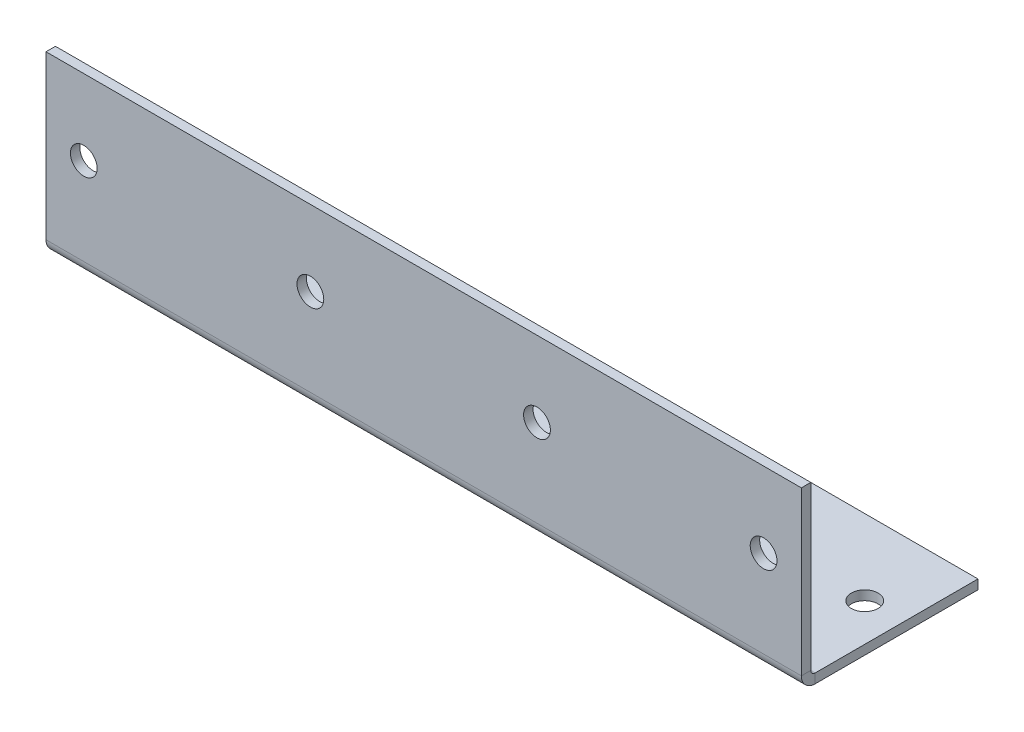
ISO-10303-21;
HEADER;
FILE_DESCRIPTION(('STEP AP214'),'2;1');
FILE_NAME('part.step','',(''),(''),'','','');
FILE_SCHEMA(('AUTOMOTIVE_DESIGN { 1 0 10303 214 1 1 1 1 }'));
ENDSEC;
DATA;
#1=APPLICATION_CONTEXT('core data for automotive mechanical design processes');
#2=APPLICATION_PROTOCOL_DEFINITION('international standard','automotive_design',2000,#1);
#3=PRODUCT_CONTEXT('',#1,'mechanical');
#4=PRODUCT('Part','Part','',(#3));
#5=PRODUCT_RELATED_PRODUCT_CATEGORY('part','',(#4));
#6=PRODUCT_DEFINITION_FORMATION('','',#4);
#7=PRODUCT_DEFINITION_CONTEXT('part definition',#1,'design');
#8=PRODUCT_DEFINITION('design','',#6,#7);
#9=PRODUCT_DEFINITION_SHAPE('','',#8);
#10=(LENGTH_UNIT() NAMED_UNIT(*) SI_UNIT(.MILLI.,.METRE.));
#11=(NAMED_UNIT(*) PLANE_ANGLE_UNIT() SI_UNIT($,.RADIAN.));
#12=(NAMED_UNIT(*) SI_UNIT($,.STERADIAN.) SOLID_ANGLE_UNIT());
#13=UNCERTAINTY_MEASURE_WITH_UNIT(LENGTH_MEASURE(1.E-05),#10,'distance_accuracy_value','');
#14=(GEOMETRIC_REPRESENTATION_CONTEXT(3) GLOBAL_UNCERTAINTY_ASSIGNED_CONTEXT((#13)) GLOBAL_UNIT_ASSIGNED_CONTEXT((#10,
#11,#12)) REPRESENTATION_CONTEXT('',''));
#15=CARTESIAN_POINT('',(0.,0.,0.));
#16=DIRECTION('',(0.,0.,1.));
#17=DIRECTION('',(1.,0.,0.));
#18=AXIS2_PLACEMENT_3D('',#15,#16,#17);
#19=CARTESIAN_POINT('',(63.5,-15.4096659206447,2.05283407935528));
#20=DIRECTION('',(1.,0.,0.));
#21=DIRECTION('',(0.,1.,0.));
#22=AXIS2_PLACEMENT_3D('',#19,#20,#21);
#23=PLANE('',#22);
#24=DIRECTION('',(0.,0.,1.));
#25=VECTOR('',#24,1.);
#26=CARTESIAN_POINT('',(63.5,-15.4096659206447,-4.29716592064472));
#27=LINE('',#26,#25);
#28=CARTESIAN_POINT('',(63.5,-15.4096659206446,-29.6971659206447));
#29=VERTEX_POINT('',#28);
#30=CARTESIAN_POINT('',(63.5,-15.4096659206447,-2.3241));
#31=VERTEX_POINT('',#30);
#32=EDGE_CURVE('E230',#29,#31,#27,.T.);
#33=ORIENTED_EDGE('',*,*,#32,.T.);
#34=DIRECTION('',(0.,-1.,0.));
#35=VECTOR('',#34,1.);
#36=CARTESIAN_POINT('',(63.5,-15.4096659206447,-2.3241));
#37=LINE('',#36,#35);
#38=CARTESIAN_POINT('',(63.5,-16.9971659206447,-2.32410000000001));
#39=VERTEX_POINT('',#38);
#40=EDGE_CURVE('E12',#31,#39,#37,.T.);
#41=ORIENTED_EDGE('',*,*,#40,.T.);
#42=DIRECTION('',(0.,0.,1.));
#43=VECTOR('',#42,1.);
#44=CARTESIAN_POINT('',(63.5,-16.9971659206447,2.05283407935528));
#45=LINE('',#44,#43);
#46=CARTESIAN_POINT('',(63.5,-16.9971659206446,-29.6971659206447));
#47=VERTEX_POINT('',#46);
#48=EDGE_CURVE('E63',#47,#39,#45,.T.);
#49=ORIENTED_EDGE('',*,*,#48,.F.);
#50=DIRECTION('',(0.,-1.,0.));
#51=VECTOR('',#50,1.);
#52=CARTESIAN_POINT('',(63.5,-15.4096659206446,-29.6971659206447));
#53=LINE('',#52,#51);
#54=EDGE_CURVE('E137',#29,#47,#53,.T.);
#55=ORIENTED_EDGE('',*,*,#54,.F.);
#56=EDGE_LOOP('',(#33,#41,#49,#55));
#57=FACE_BOUND('',#56,.T.);
#58=ADVANCED_FACE('F47',(#57),#23,.T.);
#59=CARTESIAN_POINT('',(-63.5,-15.4096659206447,-4.29716592064473));
#60=DIRECTION('',(-1.,0.,0.));
#61=DIRECTION('',(0.,-1.,0.));
#62=AXIS2_PLACEMENT_3D('',#59,#60,#61);
#63=PLANE('',#62);
#64=DIRECTION('',(0.,0.,-1.));
#65=VECTOR('',#64,1.);
#66=CARTESIAN_POINT('',(-63.5,-16.9971659206447,-4.29716592064473));
#67=LINE('',#66,#65);
#68=CARTESIAN_POINT('',(-63.5,-16.9971659206447,-2.32410000000001));
#69=VERTEX_POINT('',#68);
#70=CARTESIAN_POINT('',(-63.5,-16.9971659206446,-29.6971659206447));
#71=VERTEX_POINT('',#70);
#72=EDGE_CURVE('E70',#69,#71,#67,.T.);
#73=ORIENTED_EDGE('',*,*,#72,.F.);
#74=DIRECTION('',(0.,1.,0.));
#75=VECTOR('',#74,1.);
#76=CARTESIAN_POINT('',(-63.5,-15.4096659206447,-2.3241));
#77=LINE('',#76,#75);
#78=CARTESIAN_POINT('',(-63.4999999999999,-15.4096659206447,-2.3241));
#79=VERTEX_POINT('',#78);
#80=EDGE_CURVE('E110',#69,#79,#77,.T.);
#81=ORIENTED_EDGE('',*,*,#80,.T.);
#82=DIRECTION('',(0.,0.,-1.));
#83=VECTOR('',#82,1.);
#84=CARTESIAN_POINT('',(-63.5,-15.4096659206447,2.05283407935527));
#85=LINE('',#84,#83);
#86=CARTESIAN_POINT('',(-63.5,-15.4096659206446,-29.6971659206447));
#87=VERTEX_POINT('',#86);
#88=EDGE_CURVE('E50',#79,#87,#85,.T.);
#89=ORIENTED_EDGE('',*,*,#88,.T.);
#90=DIRECTION('',(0.,-1.,0.));
#91=VECTOR('',#90,1.);
#92=CARTESIAN_POINT('',(-63.5,-15.4096659206446,-29.6971659206447));
#93=LINE('',#92,#91);
#94=EDGE_CURVE('E235',#87,#71,#93,.T.);
#95=ORIENTED_EDGE('',*,*,#94,.T.);
#96=EDGE_LOOP('',(#73,#81,#89,#95));
#97=FACE_BOUND('',#96,.T.);
#98=ADVANCED_FACE('F112',(#97),#63,.T.);
#99=CARTESIAN_POINT('',(0.,-16.9971659206448,14.7528340793553));
#100=DIRECTION('',(0.,-1.,0.));
#101=DIRECTION('',(1.,0.,0.));
#102=AXIS2_PLACEMENT_3D('',#99,#100,#101);
#103=PLANE('',#102);
#104=CARTESIAN_POINT('',(57.15,-16.9971659206447,-16.9971659206447));
#105=DIRECTION('',(0.,-1.,0.));
#106=DIRECTION('',(-1.,0.,0.));
#107=AXIS2_PLACEMENT_3D('',#104,#105,#106);
#108=CIRCLE('',#107,2.25);
#109=CARTESIAN_POINT('',(54.9,-16.9971659206447,-16.9971659206447));
#110=VERTEX_POINT('',#109);
#111=EDGE_CURVE('E221',#110,#110,#108,.T.);
#112=ORIENTED_EDGE('',*,*,#111,.F.);
#113=EDGE_LOOP('',(#112));
#114=FACE_BOUND('',#113,.T.);
#115=CARTESIAN_POINT('',(19.05,-16.9971659206447,-16.9971659206447));
#116=DIRECTION('',(0.,-1.,0.));
#117=DIRECTION('',(-1.,0.,0.));
#118=AXIS2_PLACEMENT_3D('',#115,#116,#117);
#119=CIRCLE('',#118,2.25);
#120=CARTESIAN_POINT('',(16.8,-16.9971659206447,-16.9971659206447));
#121=VERTEX_POINT('',#120);
#122=EDGE_CURVE('E215',#121,#121,#119,.T.);
#123=ORIENTED_EDGE('',*,*,#122,.F.);
#124=EDGE_LOOP('',(#123));
#125=FACE_BOUND('',#124,.T.);
#126=CARTESIAN_POINT('',(-19.05,-16.9971659206447,-16.9971659206447));
#127=DIRECTION('',(0.,-1.,0.));
#128=DIRECTION('',(-1.,0.,0.));
#129=AXIS2_PLACEMENT_3D('',#126,#127,#128);
#130=CIRCLE('',#129,2.25);
#131=CARTESIAN_POINT('',(-21.3,-16.9971659206447,-16.9971659206447));
#132=VERTEX_POINT('',#131);
#133=EDGE_CURVE('E209',#132,#132,#130,.T.);
#134=ORIENTED_EDGE('',*,*,#133,.F.);
#135=EDGE_LOOP('',(#134));
#136=FACE_BOUND('',#135,.T.);
#137=CARTESIAN_POINT('',(-57.15,-16.9971659206447,-16.9971659206447));
#138=DIRECTION('',(0.,-1.,0.));
#139=DIRECTION('',(-1.,0.,0.));
#140=AXIS2_PLACEMENT_3D('',#137,#138,#139);
#141=CIRCLE('',#140,2.25);
#142=CARTESIAN_POINT('',(-59.4,-16.9971659206447,-16.9971659206447));
#143=VERTEX_POINT('',#142);
#144=EDGE_CURVE('E158',#143,#143,#141,.T.);
#145=ORIENTED_EDGE('',*,*,#144,.F.);
#146=EDGE_LOOP('',(#145));
#147=FACE_BOUND('',#146,.T.);
#148=ORIENTED_EDGE('',*,*,#48,.T.);
#149=DIRECTION('',(-1.,0.,0.));
#150=VECTOR('',#149,1.);
#151=CARTESIAN_POINT('',(0.,-16.9971659206447,-2.32410000000002));
#152=LINE('',#151,#150);
#153=EDGE_CURVE('E55',#39,#69,#152,.T.);
#154=ORIENTED_EDGE('',*,*,#153,.T.);
#155=ORIENTED_EDGE('',*,*,#72,.T.);
#156=DIRECTION('',(1.,0.,0.));
#157=VECTOR('',#156,1.);
#158=CARTESIAN_POINT('',(63.5,-16.9971659206446,-29.6971659206447));
#159=LINE('',#158,#157);
#160=EDGE_CURVE('E231',#71,#47,#159,.T.);
#161=ORIENTED_EDGE('',*,*,#160,.T.);
#162=EDGE_LOOP('',(#148,#154,#155,#161));
#163=FACE_BOUND('',#162,.T.);
#164=ADVANCED_FACE('F239',(#114,#125,#136,#147,#163),#103,.T.);
#165=CARTESIAN_POINT('',(63.5,-15.4096659206446,-29.6971659206447));
#166=DIRECTION('',(0.,0.,-1.));
#167=DIRECTION('',(1.,0.,0.));
#168=AXIS2_PLACEMENT_3D('',#165,#166,#167);
#169=PLANE('',#168);
#170=ORIENTED_EDGE('',*,*,#160,.F.);
#171=ORIENTED_EDGE('',*,*,#94,.F.);
#172=DIRECTION('',(1.,0.,0.));
#173=VECTOR('',#172,1.);
#174=CARTESIAN_POINT('',(63.5,-15.4096659206446,-29.6971659206447));
#175=LINE('',#174,#173);
#176=EDGE_CURVE('E128',#87,#29,#175,.T.);
#177=ORIENTED_EDGE('',*,*,#176,.T.);
#178=ORIENTED_EDGE('',*,*,#54,.T.);
#179=EDGE_LOOP('',(#170,#171,#177,#178));
#180=FACE_BOUND('',#179,.T.);
#181=ADVANCED_FACE('F243',(#180),#169,.T.);
#182=CARTESIAN_POINT('',(0.,-15.4096659206448,14.7528340793553));
#183=DIRECTION('',(0.,-1.,0.));
#184=DIRECTION('',(1.,0.,0.));
#185=AXIS2_PLACEMENT_3D('',#182,#183,#184);
#186=PLANE('',#185);
#187=DIRECTION('',(-1.,0.,0.));
#188=VECTOR('',#187,1.);
#189=CARTESIAN_POINT('',(0.,-15.4096659206447,-2.3241));
#190=LINE('',#189,#188);
#191=EDGE_CURVE('E118',#31,#79,#190,.T.);
#192=ORIENTED_EDGE('',*,*,#191,.F.);
#193=ORIENTED_EDGE('',*,*,#32,.F.);
#194=ORIENTED_EDGE('',*,*,#176,.F.);
#195=ORIENTED_EDGE('',*,*,#88,.F.);
#196=EDGE_LOOP('',(#192,#193,#194,#195));
#197=FACE_BOUND('',#196,.T.);
#198=CARTESIAN_POINT('',(-57.15,-15.4096659206447,-16.9971659206447));
#199=DIRECTION('',(0.,-1.,0.));
#200=DIRECTION('',(-1.,0.,0.));
#201=AXIS2_PLACEMENT_3D('',#198,#199,#200);
#202=CIRCLE('',#201,2.25);
#203=CARTESIAN_POINT('',(-59.4,-15.4096659206447,-16.9971659206447));
#204=VERTEX_POINT('',#203);
#205=EDGE_CURVE('E206',#204,#204,#202,.T.);
#206=ORIENTED_EDGE('',*,*,#205,.T.);
#207=EDGE_LOOP('',(#206));
#208=FACE_BOUND('',#207,.T.);
#209=CARTESIAN_POINT('',(-19.05,-15.4096659206447,-16.9971659206447));
#210=DIRECTION('',(0.,-1.,0.));
#211=DIRECTION('',(-1.,0.,0.));
#212=AXIS2_PLACEMENT_3D('',#209,#210,#211);
#213=CIRCLE('',#212,2.25);
#214=CARTESIAN_POINT('',(-21.3,-15.4096659206447,-16.9971659206447));
#215=VERTEX_POINT('',#214);
#216=EDGE_CURVE('E212',#215,#215,#213,.T.);
#217=ORIENTED_EDGE('',*,*,#216,.T.);
#218=EDGE_LOOP('',(#217));
#219=FACE_BOUND('',#218,.T.);
#220=CARTESIAN_POINT('',(19.05,-15.4096659206447,-16.9971659206447));
#221=DIRECTION('',(0.,-1.,0.));
#222=DIRECTION('',(-1.,0.,0.));
#223=AXIS2_PLACEMENT_3D('',#220,#221,#222);
#224=CIRCLE('',#223,2.25);
#225=CARTESIAN_POINT('',(16.8,-15.4096659206447,-16.9971659206447));
#226=VERTEX_POINT('',#225);
#227=EDGE_CURVE('E218',#226,#226,#224,.T.);
#228=ORIENTED_EDGE('',*,*,#227,.T.);
#229=EDGE_LOOP('',(#228));
#230=FACE_BOUND('',#229,.T.);
#231=CARTESIAN_POINT('',(57.15,-15.4096659206447,-16.9971659206447));
#232=DIRECTION('',(0.,-1.,0.));
#233=DIRECTION('',(-1.,0.,0.));
#234=AXIS2_PLACEMENT_3D('',#231,#232,#233);
#235=CIRCLE('',#234,2.25);
#236=CARTESIAN_POINT('',(54.9,-15.4096659206447,-16.9971659206447));
#237=VERTEX_POINT('',#236);
#238=EDGE_CURVE('E224',#237,#237,#235,.T.);
#239=ORIENTED_EDGE('',*,*,#238,.T.);
#240=EDGE_LOOP('',(#239));
#241=FACE_BOUND('',#240,.T.);
#242=ADVANCED_FACE('F123',(#197,#208,#219,#230,#241),#186,.F.);
#243=CARTESIAN_POINT('',(57.15,-15.4096659206447,-16.9971659206447));
#244=DIRECTION('',(0.,-1.,0.));
#245=DIRECTION('',(1.,0.,0.));
#246=AXIS2_PLACEMENT_3D('',#243,#244,#245);
#247=CYLINDRICAL_SURFACE('',#246,2.25);
#248=ORIENTED_EDGE('',*,*,#238,.F.);
#249=EDGE_LOOP('',(#248));
#250=FACE_BOUND('',#249,.T.);
#251=ORIENTED_EDGE('',*,*,#111,.T.);
#252=EDGE_LOOP('',(#251));
#253=FACE_BOUND('',#252,.T.);
#254=ADVANCED_FACE('F295',(#250,#253),#247,.F.);
#255=CARTESIAN_POINT('',(19.05,-15.4096659206447,-16.9971659206447));
#256=DIRECTION('',(0.,-1.,0.));
#257=DIRECTION('',(1.,0.,0.));
#258=AXIS2_PLACEMENT_3D('',#255,#256,#257);
#259=CYLINDRICAL_SURFACE('',#258,2.25);
#260=ORIENTED_EDGE('',*,*,#227,.F.);
#261=EDGE_LOOP('',(#260));
#262=FACE_BOUND('',#261,.T.);
#263=ORIENTED_EDGE('',*,*,#122,.T.);
#264=EDGE_LOOP('',(#263));
#265=FACE_BOUND('',#264,.T.);
#266=ADVANCED_FACE('F300',(#262,#265),#259,.F.);
#267=CARTESIAN_POINT('',(-19.05,-15.4096659206447,-16.9971659206447));
#268=DIRECTION('',(0.,-1.,0.));
#269=DIRECTION('',(1.,0.,0.));
#270=AXIS2_PLACEMENT_3D('',#267,#268,#269);
#271=CYLINDRICAL_SURFACE('',#270,2.25);
#272=ORIENTED_EDGE('',*,*,#216,.F.);
#273=EDGE_LOOP('',(#272));
#274=FACE_BOUND('',#273,.T.);
#275=ORIENTED_EDGE('',*,*,#133,.T.);
#276=EDGE_LOOP('',(#275));
#277=FACE_BOUND('',#276,.T.);
#278=ADVANCED_FACE('F279',(#274,#277),#271,.F.);
#279=CARTESIAN_POINT('',(-57.15,-15.4096659206447,-16.9971659206447));
#280=DIRECTION('',(0.,-1.,0.));
#281=DIRECTION('',(1.,0.,0.));
#282=AXIS2_PLACEMENT_3D('',#279,#280,#281);
#283=CYLINDRICAL_SURFACE('',#282,2.25);
#284=ORIENTED_EDGE('',*,*,#205,.F.);
#285=EDGE_LOOP('',(#284));
#286=FACE_BOUND('',#285,.T.);
#287=ORIENTED_EDGE('',*,*,#144,.T.);
#288=EDGE_LOOP('',(#287));
#289=FACE_BOUND('',#288,.T.);
#290=ADVANCED_FACE('F270',(#286,#289),#283,.F.);
#291=CARTESIAN_POINT('',(63.5,12.7,-1.5875));
#292=DIRECTION('',(0.,1.,0.));
#293=DIRECTION('',(-1.,0.,0.));
#294=AXIS2_PLACEMENT_3D('',#291,#292,#293);
#295=PLANE('',#294);
#296=DIRECTION('',(-1.,0.,0.));
#297=VECTOR('',#296,1.);
#298=CARTESIAN_POINT('',(63.5,12.7,0.));
#299=LINE('',#298,#297);
#300=CARTESIAN_POINT('',(63.5,12.7,0.));
#301=VERTEX_POINT('',#300);
#302=CARTESIAN_POINT('',(-63.5,12.7,0.));
#303=VERTEX_POINT('',#302);
#304=EDGE_CURVE('E163',#301,#303,#299,.T.);
#305=ORIENTED_EDGE('',*,*,#304,.F.);
#306=DIRECTION('',(0.,0.,1.));
#307=VECTOR('',#306,1.);
#308=CARTESIAN_POINT('',(63.5,12.7,-1.5875));
#309=LINE('',#308,#307);
#310=CARTESIAN_POINT('',(63.5,12.7,-1.5875));
#311=VERTEX_POINT('',#310);
#312=EDGE_CURVE('E155',#311,#301,#309,.T.);
#313=ORIENTED_EDGE('',*,*,#312,.F.);
#314=DIRECTION('',(-1.,0.,0.));
#315=VECTOR('',#314,1.);
#316=CARTESIAN_POINT('',(63.5,12.7,-1.5875));
#317=LINE('',#316,#315);
#318=CARTESIAN_POINT('',(-63.5,12.7,-1.5875));
#319=VERTEX_POINT('',#318);
#320=EDGE_CURVE('E200',#311,#319,#317,.T.);
#321=ORIENTED_EDGE('',*,*,#320,.T.);
#322=DIRECTION('',(0.,0.,1.));
#323=VECTOR('',#322,1.);
#324=CARTESIAN_POINT('',(-63.5,12.7,-1.5875));
#325=LINE('',#324,#323);
#326=EDGE_CURVE('E197',#319,#303,#325,.T.);
#327=ORIENTED_EDGE('',*,*,#326,.T.);
#328=EDGE_LOOP('',(#305,#313,#321,#327));
#329=FACE_BOUND('',#328,.T.);
#330=ADVANCED_FACE('F267',(#329),#295,.T.);
#331=CARTESIAN_POINT('',(57.15,0.,-1.5875));
#332=DIRECTION('',(0.,0.,1.));
#333=DIRECTION('',(1.,0.,0.));
#334=AXIS2_PLACEMENT_3D('',#331,#332,#333);
#335=CYLINDRICAL_SURFACE('',#334,2.25);
#336=CARTESIAN_POINT('',(57.15,0.,-1.5875));
#337=DIRECTION('',(0.,0.,1.));
#338=DIRECTION('',(1.,0.,0.));
#339=AXIS2_PLACEMENT_3D('',#336,#337,#338);
#340=CIRCLE('',#339,2.25);
#341=CARTESIAN_POINT('',(59.4,0.,-1.5875));
#342=VERTEX_POINT('',#341);
#343=EDGE_CURVE('E173',#342,#342,#340,.T.);
#344=ORIENTED_EDGE('',*,*,#343,.F.);
#345=EDGE_LOOP('',(#344));
#346=FACE_BOUND('',#345,.T.);
#347=CARTESIAN_POINT('',(57.15,0.,0.));
#348=DIRECTION('',(0.,0.,1.));
#349=DIRECTION('',(1.,0.,0.));
#350=AXIS2_PLACEMENT_3D('',#347,#348,#349);
#351=CIRCLE('',#350,2.25);
#352=CARTESIAN_POINT('',(59.4,0.,0.));
#353=VERTEX_POINT('',#352);
#354=EDGE_CURVE('E194',#353,#353,#351,.T.);
#355=ORIENTED_EDGE('',*,*,#354,.T.);
#356=EDGE_LOOP('',(#355));
#357=FACE_BOUND('',#356,.T.);
#358=ADVANCED_FACE('F269',(#346,#357),#335,.F.);
#359=CARTESIAN_POINT('',(19.05,0.,-1.5875));
#360=DIRECTION('',(0.,0.,1.));
#361=DIRECTION('',(1.,0.,0.));
#362=AXIS2_PLACEMENT_3D('',#359,#360,#361);
#363=CYLINDRICAL_SURFACE('',#362,2.25);
#364=CARTESIAN_POINT('',(19.05,0.,-1.5875));
#365=DIRECTION('',(0.,0.,1.));
#366=DIRECTION('',(1.,0.,0.));
#367=AXIS2_PLACEMENT_3D('',#364,#365,#366);
#368=CIRCLE('',#367,2.25);
#369=CARTESIAN_POINT('',(21.3,0.,-1.5875));
#370=VERTEX_POINT('',#369);
#371=EDGE_CURVE('E176',#370,#370,#368,.T.);
#372=ORIENTED_EDGE('',*,*,#371,.F.);
#373=EDGE_LOOP('',(#372));
#374=FACE_BOUND('',#373,.T.);
#375=CARTESIAN_POINT('',(19.05,0.,0.));
#376=DIRECTION('',(0.,0.,1.));
#377=DIRECTION('',(1.,0.,0.));
#378=AXIS2_PLACEMENT_3D('',#375,#376,#377);
#379=CIRCLE('',#378,2.25);
#380=CARTESIAN_POINT('',(21.3,0.,0.));
#381=VERTEX_POINT('',#380);
#382=EDGE_CURVE('E191',#381,#381,#379,.T.);
#383=ORIENTED_EDGE('',*,*,#382,.T.);
#384=EDGE_LOOP('',(#383));
#385=FACE_BOUND('',#384,.T.);
#386=ADVANCED_FACE('F276',(#374,#385),#363,.F.);
#387=CARTESIAN_POINT('',(-19.05,0.,-1.5875));
#388=DIRECTION('',(0.,0.,1.));
#389=DIRECTION('',(1.,0.,0.));
#390=AXIS2_PLACEMENT_3D('',#387,#388,#389);
#391=CYLINDRICAL_SURFACE('',#390,2.25);
#392=CARTESIAN_POINT('',(-19.05,0.,-1.5875));
#393=DIRECTION('',(0.,0.,1.));
#394=DIRECTION('',(1.,0.,0.));
#395=AXIS2_PLACEMENT_3D('',#392,#393,#394);
#396=CIRCLE('',#395,2.25);
#397=CARTESIAN_POINT('',(-16.8,0.,-1.5875));
#398=VERTEX_POINT('',#397);
#399=EDGE_CURVE('E179',#398,#398,#396,.T.);
#400=ORIENTED_EDGE('',*,*,#399,.F.);
#401=EDGE_LOOP('',(#400));
#402=FACE_BOUND('',#401,.T.);
#403=CARTESIAN_POINT('',(-19.05,0.,0.));
#404=DIRECTION('',(0.,0.,1.));
#405=DIRECTION('',(1.,0.,0.));
#406=AXIS2_PLACEMENT_3D('',#403,#404,#405);
#407=CIRCLE('',#406,2.25);
#408=CARTESIAN_POINT('',(-16.8,0.,0.));
#409=VERTEX_POINT('',#408);
#410=EDGE_CURVE('E188',#409,#409,#407,.T.);
#411=ORIENTED_EDGE('',*,*,#410,.T.);
#412=EDGE_LOOP('',(#411));
#413=FACE_BOUND('',#412,.T.);
#414=ADVANCED_FACE('F320',(#402,#413),#391,.F.);
#415=CARTESIAN_POINT('',(-57.15,0.,-1.5875));
#416=DIRECTION('',(0.,0.,1.));
#417=DIRECTION('',(1.,0.,0.));
#418=AXIS2_PLACEMENT_3D('',#415,#416,#417);
#419=CYLINDRICAL_SURFACE('',#418,2.25);
#420=CARTESIAN_POINT('',(-57.15,0.,-1.5875));
#421=DIRECTION('',(0.,0.,1.));
#422=DIRECTION('',(1.,0.,0.));
#423=AXIS2_PLACEMENT_3D('',#420,#421,#422);
#424=CIRCLE('',#423,2.25);
#425=CARTESIAN_POINT('',(-54.9,0.,-1.5875));
#426=VERTEX_POINT('',#425);
#427=EDGE_CURVE('E182',#426,#426,#424,.T.);
#428=ORIENTED_EDGE('',*,*,#427,.F.);
#429=EDGE_LOOP('',(#428));
#430=FACE_BOUND('',#429,.T.);
#431=CARTESIAN_POINT('',(-57.15,0.,0.));
#432=DIRECTION('',(0.,0.,1.));
#433=DIRECTION('',(1.,0.,0.));
#434=AXIS2_PLACEMENT_3D('',#431,#432,#433);
#435=CIRCLE('',#434,2.25);
#436=CARTESIAN_POINT('',(-54.9,0.,0.));
#437=VERTEX_POINT('',#436);
#438=EDGE_CURVE('E185',#437,#437,#435,.T.);
#439=ORIENTED_EDGE('',*,*,#438,.T.);
#440=EDGE_LOOP('',(#439));
#441=FACE_BOUND('',#440,.T.);
#442=ADVANCED_FACE('F316',(#430,#441),#419,.F.);
#443=CARTESIAN_POINT('',(0.,0.,-1.5875));
#444=DIRECTION('',(0.,0.,1.));
#445=DIRECTION('',(1.,0.,0.));
#446=AXIS2_PLACEMENT_3D('',#443,#444,#445);
#447=PLANE('',#446);
#448=ORIENTED_EDGE('',*,*,#427,.T.);
#449=EDGE_LOOP('',(#448));
#450=FACE_BOUND('',#449,.T.);
#451=ORIENTED_EDGE('',*,*,#399,.T.);
#452=EDGE_LOOP('',(#451));
#453=FACE_BOUND('',#452,.T.);
#454=ORIENTED_EDGE('',*,*,#371,.T.);
#455=EDGE_LOOP('',(#454));
#456=FACE_BOUND('',#455,.T.);
#457=ORIENTED_EDGE('',*,*,#343,.T.);
#458=EDGE_LOOP('',(#457));
#459=FACE_BOUND('',#458,.T.);
#460=DIRECTION('',(0.,1.,0.));
#461=VECTOR('',#460,1.);
#462=CARTESIAN_POINT('',(63.5,-19.05,-1.5875));
#463=LINE('',#462,#461);
#464=CARTESIAN_POINT('',(63.5,-14.6730659206447,-1.5875));
#465=VERTEX_POINT('',#464);
#466=EDGE_CURVE('E159',#465,#311,#463,.T.);
#467=ORIENTED_EDGE('',*,*,#466,.F.);
#468=DIRECTION('',(-1.,0.,0.));
#469=VECTOR('',#468,1.);
#470=CARTESIAN_POINT('',(0.,-14.6730659206447,-1.5875));
#471=LINE('',#470,#469);
#472=CARTESIAN_POINT('',(-63.4999999999999,-14.6730659206447,-1.5875));
#473=VERTEX_POINT('',#472);
#474=EDGE_CURVE('E170',#465,#473,#471,.T.);
#475=ORIENTED_EDGE('',*,*,#474,.T.);
#476=DIRECTION('',(0.,-1.,0.));
#477=VECTOR('',#476,1.);
#478=CARTESIAN_POINT('',(-63.5,-12.7,-1.5875));
#479=LINE('',#478,#477);
#480=EDGE_CURVE('E168',#319,#473,#479,.T.);
#481=ORIENTED_EDGE('',*,*,#480,.F.);
#482=ORIENTED_EDGE('',*,*,#320,.F.);
#483=EDGE_LOOP('',(#467,#475,#481,#482));
#484=FACE_BOUND('',#483,.T.);
#485=ADVANCED_FACE('F265',(#450,#453,#456,#459,#484),#447,.F.);
#486=CARTESIAN_POINT('',(-63.5,-19.05,-1.5875));
#487=DIRECTION('',(-1.,0.,0.));
#488=DIRECTION('',(0.,0.,1.));
#489=AXIS2_PLACEMENT_3D('',#486,#487,#488);
#490=PLANE('',#489);
#491=DIRECTION('',(0.,0.,-1.));
#492=VECTOR('',#491,1.);
#493=CARTESIAN_POINT('',(-63.5,-14.6730659206447,-1.58749999999997));
#494=LINE('',#493,#492);
#495=CARTESIAN_POINT('',(-63.5,-14.6730659206447,0.));
#496=VERTEX_POINT('',#495);
#497=EDGE_CURVE('E142',#496,#473,#494,.T.);
#498=ORIENTED_EDGE('',*,*,#497,.F.);
#499=DIRECTION('',(0.,-1.,0.));
#500=VECTOR('',#499,1.);
#501=CARTESIAN_POINT('',(-63.5,-19.05,0.));
#502=LINE('',#501,#500);
#503=EDGE_CURVE('E161',#303,#496,#502,.T.);
#504=ORIENTED_EDGE('',*,*,#503,.F.);
#505=ORIENTED_EDGE('',*,*,#326,.F.);
#506=ORIENTED_EDGE('',*,*,#480,.T.);
#507=EDGE_LOOP('',(#498,#504,#505,#506));
#508=FACE_BOUND('',#507,.T.);
#509=ADVANCED_FACE('F261',(#508),#490,.T.);
#510=CARTESIAN_POINT('',(0.,0.,0.));
#511=DIRECTION('',(0.,0.,1.));
#512=DIRECTION('',(1.,0.,0.));
#513=AXIS2_PLACEMENT_3D('',#510,#511,#512);
#514=PLANE('',#513);
#515=DIRECTION('',(-1.,0.,0.));
#516=VECTOR('',#515,1.);
#517=CARTESIAN_POINT('',(0.,-14.6730659206447,0.));
#518=LINE('',#517,#516);
#519=CARTESIAN_POINT('',(63.5,-14.6730659206447,0.));
#520=VERTEX_POINT('',#519);
#521=EDGE_CURVE('E146',#520,#496,#518,.T.);
#522=ORIENTED_EDGE('',*,*,#521,.F.);
#523=DIRECTION('',(0.,1.,0.));
#524=VECTOR('',#523,1.);
#525=CARTESIAN_POINT('',(63.5,-12.7,0.));
#526=LINE('',#525,#524);
#527=EDGE_CURVE('E166',#520,#301,#526,.T.);
#528=ORIENTED_EDGE('',*,*,#527,.T.);
#529=ORIENTED_EDGE('',*,*,#304,.T.);
#530=ORIENTED_EDGE('',*,*,#503,.T.);
#531=EDGE_LOOP('',(#522,#528,#529,#530));
#532=FACE_BOUND('',#531,.T.);
#533=ORIENTED_EDGE('',*,*,#354,.F.);
#534=EDGE_LOOP('',(#533));
#535=FACE_BOUND('',#534,.T.);
#536=ORIENTED_EDGE('',*,*,#382,.F.);
#537=EDGE_LOOP('',(#536));
#538=FACE_BOUND('',#537,.T.);
#539=ORIENTED_EDGE('',*,*,#410,.F.);
#540=EDGE_LOOP('',(#539));
#541=FACE_BOUND('',#540,.T.);
#542=ORIENTED_EDGE('',*,*,#438,.F.);
#543=EDGE_LOOP('',(#542));
#544=FACE_BOUND('',#543,.T.);
#545=ADVANCED_FACE('F258',(#532,#535,#538,#541,#544),#514,.T.);
#546=CARTESIAN_POINT('',(63.5,-12.7,-1.5875));
#547=DIRECTION('',(1.,0.,0.));
#548=DIRECTION('',(0.,0.,-1.));
#549=AXIS2_PLACEMENT_3D('',#546,#547,#548);
#550=PLANE('',#549);
#551=DIRECTION('',(0.,0.,1.));
#552=VECTOR('',#551,1.);
#553=CARTESIAN_POINT('',(63.5,-14.6730659206447,-1.58750000000001));
#554=LINE('',#553,#552);
#555=EDGE_CURVE('E143',#465,#520,#554,.T.);
#556=ORIENTED_EDGE('',*,*,#555,.F.);
#557=ORIENTED_EDGE('',*,*,#466,.T.);
#558=ORIENTED_EDGE('',*,*,#312,.T.);
#559=ORIENTED_EDGE('',*,*,#527,.F.);
#560=EDGE_LOOP('',(#556,#557,#558,#559));
#561=FACE_BOUND('',#560,.T.);
#562=ADVANCED_FACE('F253',(#561),#550,.T.);
#563=CARTESIAN_POINT('',(63.5000000000001,-14.6730659206447,-2.3241));
#564=DIRECTION('',(-1.,0.,0.));
#565=DIRECTION('',(0.,0.,1.));
#566=AXIS2_PLACEMENT_3D('',#563,#564,#565);
#567=PLANE('',#566);
#568=ORIENTED_EDGE('',*,*,#555,.T.);
#569=CARTESIAN_POINT('',(63.5000000000001,-14.6730659206447,-2.3241));
#570=DIRECTION('',(-1.,0.,0.));
#571=DIRECTION('',(0.,0.,1.));
#572=AXIS2_PLACEMENT_3D('',#569,#570,#571);
#573=CIRCLE('',#572,2.3241);
#574=EDGE_CURVE('E152',#520,#39,#573,.F.);
#575=ORIENTED_EDGE('',*,*,#574,.T.);
#576=ORIENTED_EDGE('',*,*,#40,.F.);
#577=CARTESIAN_POINT('',(63.5000000000001,-14.6730659206447,-2.3241));
#578=DIRECTION('',(1.,0.,0.));
#579=DIRECTION('',(0.,0.,1.));
#580=AXIS2_PLACEMENT_3D('',#577,#578,#579);
#581=CIRCLE('',#580,0.7366);
#582=EDGE_CURVE('E136',#465,#31,#581,.T.);
#583=ORIENTED_EDGE('',*,*,#582,.F.);
#584=EDGE_LOOP('',(#568,#575,#576,#583));
#585=FACE_BOUND('',#584,.T.);
#586=ADVANCED_FACE('F250',(#585),#567,.F.);
#587=CARTESIAN_POINT('',(-63.4999999999999,-14.6730659206447,-2.3241));
#588=DIRECTION('',(1.,0.,0.));
#589=DIRECTION('',(0.,0.,-1.));
#590=AXIS2_PLACEMENT_3D('',#587,#588,#589);
#591=PLANE('',#590);
#592=ORIENTED_EDGE('',*,*,#80,.F.);
#593=CARTESIAN_POINT('',(-63.4999999999999,-14.6730659206447,-2.3241));
#594=DIRECTION('',(-1.,0.,0.));
#595=DIRECTION('',(0.,0.,1.));
#596=AXIS2_PLACEMENT_3D('',#593,#594,#595);
#597=CIRCLE('',#596,2.3241);
#598=EDGE_CURVE('E148',#69,#496,#597,.T.);
#599=ORIENTED_EDGE('',*,*,#598,.T.);
#600=ORIENTED_EDGE('',*,*,#497,.T.);
#601=CARTESIAN_POINT('',(-63.4999999999999,-14.6730659206447,-2.3241));
#602=DIRECTION('',(-1.,0.,0.));
#603=DIRECTION('',(0.,0.,-1.));
#604=AXIS2_PLACEMENT_3D('',#601,#602,#603);
#605=CIRCLE('',#604,0.7366);
#606=EDGE_CURVE('E134',#79,#473,#605,.T.);
#607=ORIENTED_EDGE('',*,*,#606,.F.);
#608=EDGE_LOOP('',(#592,#599,#600,#607));
#609=FACE_BOUND('',#608,.T.);
#610=ADVANCED_FACE('F140',(#609),#591,.F.);
#611=CARTESIAN_POINT('',(127.032667996758,-14.6730659206447,-2.3241));
#612=DIRECTION('',(-1.,0.,0.));
#613=DIRECTION('',(0.,0.,1.));
#614=AXIS2_PLACEMENT_3D('',#611,#612,#613);
#615=CYLINDRICAL_SURFACE('',#614,0.7366);
#616=ORIENTED_EDGE('',*,*,#606,.T.);
#617=ORIENTED_EDGE('',*,*,#474,.F.);
#618=ORIENTED_EDGE('',*,*,#582,.T.);
#619=ORIENTED_EDGE('',*,*,#191,.T.);
#620=EDGE_LOOP('',(#616,#617,#618,#619));
#621=FACE_BOUND('',#620,.T.);
#622=ADVANCED_FACE('F132',(#621),#615,.F.);
#623=CARTESIAN_POINT('',(127.032667996758,-14.6730659206447,-2.3241));
#624=DIRECTION('',(-1.,0.,0.));
#625=DIRECTION('',(0.,0.,1.));
#626=AXIS2_PLACEMENT_3D('',#623,#624,#625);
#627=CYLINDRICAL_SURFACE('',#626,2.3241);
#628=ORIENTED_EDGE('',*,*,#598,.F.);
#629=ORIENTED_EDGE('',*,*,#153,.F.);
#630=ORIENTED_EDGE('',*,*,#574,.F.);
#631=ORIENTED_EDGE('',*,*,#521,.T.);
#632=EDGE_LOOP('',(#628,#629,#630,#631));
#633=FACE_BOUND('',#632,.T.);
#634=ADVANCED_FACE('F249',(#633),#627,.T.);
#635=CLOSED_SHELL('',(#58,#98,#164,#181,#242,#254,#266,#278,#290,#330,#358,#386,#414,#442,#485,
#509,#545,#562,#586,#610,#622,#634));
#636=MANIFOLD_SOLID_BREP('B2',#635);
#637=ADVANCED_BREP_SHAPE_REPRESENTATION('',(#18,#636),#14);
#638=SHAPE_DEFINITION_REPRESENTATION(#9,#637);
ENDSEC;
END-ISO-10303-21;
